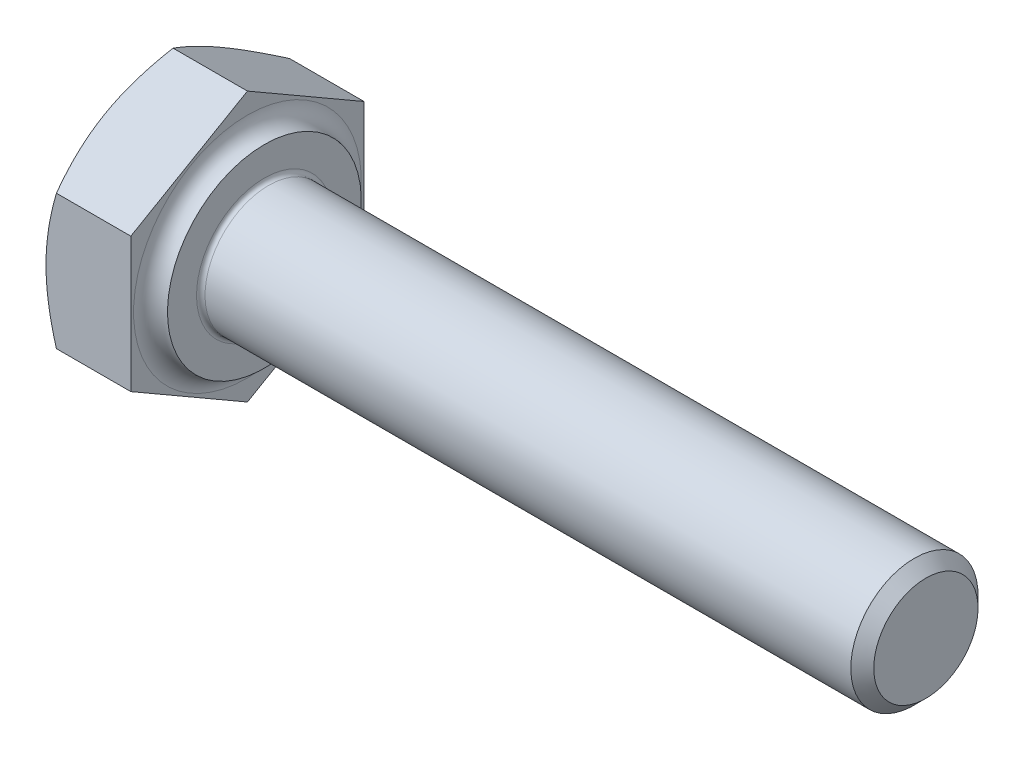
ISO-10303-21;
HEADER;
FILE_DESCRIPTION(('STEP AP214'),'2;1');
FILE_NAME('part.step','',(''),(''),'','','');
FILE_SCHEMA(('AUTOMOTIVE_DESIGN { 1 0 10303 214 1 1 1 1 }'));
ENDSEC;
DATA;
#1=APPLICATION_CONTEXT('core data for automotive mechanical design processes');
#2=APPLICATION_PROTOCOL_DEFINITION('international standard','automotive_design',2000,#1);
#3=PRODUCT_CONTEXT('',#1,'mechanical');
#4=PRODUCT('Part','Part','',(#3));
#5=PRODUCT_RELATED_PRODUCT_CATEGORY('part','',(#4));
#6=PRODUCT_DEFINITION_FORMATION('','',#4);
#7=PRODUCT_DEFINITION_CONTEXT('part definition',#1,'design');
#8=PRODUCT_DEFINITION('design','',#6,#7);
#9=PRODUCT_DEFINITION_SHAPE('','',#8);
#10=(LENGTH_UNIT() NAMED_UNIT(*) SI_UNIT(.MILLI.,.METRE.));
#11=(NAMED_UNIT(*) PLANE_ANGLE_UNIT() SI_UNIT($,.RADIAN.));
#12=(NAMED_UNIT(*) SI_UNIT($,.STERADIAN.) SOLID_ANGLE_UNIT());
#13=UNCERTAINTY_MEASURE_WITH_UNIT(LENGTH_MEASURE(1.E-05),#10,'distance_accuracy_value','');
#14=(GEOMETRIC_REPRESENTATION_CONTEXT(3) GLOBAL_UNCERTAINTY_ASSIGNED_CONTEXT((#13)) GLOBAL_UNIT_ASSIGNED_CONTEXT((#10,
#11,#12)) REPRESENTATION_CONTEXT('',''));
#15=CARTESIAN_POINT('',(0.,0.,0.));
#16=DIRECTION('',(0.,0.,1.));
#17=DIRECTION('',(1.,0.,0.));
#18=AXIS2_PLACEMENT_3D('',#15,#16,#17);
#19=CARTESIAN_POINT('',(0.4,0.,0.));
#20=DIRECTION('',(1.,0.,0.));
#21=DIRECTION('',(0.,0.,-1.));
#22=AXIS2_PLACEMENT_3D('',#19,#20,#21);
#23=TOROIDAL_SURFACE('',#22,2.685,0.4);
#24=CARTESIAN_POINT('',(0.4,0.,0.));
#25=DIRECTION('',(1.,0.,0.));
#26=DIRECTION('',(0.,1.,0.));
#27=AXIS2_PLACEMENT_3D('',#24,#25,#26);
#28=CIRCLE('',#27,2.285);
#29=CARTESIAN_POINT('',(0.4,2.285,0.));
#30=VERTEX_POINT('',#29);
#31=EDGE_CURVE('E12',#30,#30,#28,.T.);
#32=ORIENTED_EDGE('',*,*,#31,.F.);
#33=EDGE_LOOP('',(#32));
#34=FACE_BOUND('',#33,.T.);
#35=CARTESIAN_POINT('',(0.,0.,0.));
#36=DIRECTION('',(-1.,0.,0.));
#37=DIRECTION('',(0.,1.,0.));
#38=AXIS2_PLACEMENT_3D('',#35,#36,#37);
#39=CIRCLE('',#38,2.685);
#40=CARTESIAN_POINT('',(0.,2.685,0.));
#41=VERTEX_POINT('',#40);
#42=EDGE_CURVE('E40',#41,#41,#39,.T.);
#43=ORIENTED_EDGE('',*,*,#42,.F.);
#44=EDGE_LOOP('',(#43));
#45=FACE_BOUND('',#44,.T.);
#46=ADVANCED_FACE('F19',(#34,#45),#23,.F.);
#47=CARTESIAN_POINT('',(0.4,1.9425,0.));
#48=DIRECTION('',(1.,0.,0.));
#49=DIRECTION('',(0.,1.,0.));
#50=AXIS2_PLACEMENT_3D('',#47,#48,#49);
#51=PLANE('',#50);
#52=CARTESIAN_POINT('',(0.4,0.,0.));
#53=DIRECTION('',(1.,0.,0.));
#54=DIRECTION('',(0.,1.,0.));
#55=AXIS2_PLACEMENT_3D('',#52,#53,#54);
#56=CIRCLE('',#55,1.6);
#57=CARTESIAN_POINT('',(0.4,1.6,0.));
#58=VERTEX_POINT('',#57);
#59=EDGE_CURVE('E30',#58,#58,#56,.T.);
#60=ORIENTED_EDGE('',*,*,#59,.F.);
#61=EDGE_LOOP('',(#60));
#62=FACE_BOUND('',#61,.T.);
#63=ORIENTED_EDGE('',*,*,#31,.T.);
#64=EDGE_LOOP('',(#63));
#65=FACE_BOUND('',#64,.T.);
#66=ADVANCED_FACE('F365',(#62,#65),#51,.T.);
#67=CARTESIAN_POINT('',(0.5,0.,0.));
#68=DIRECTION('',(1.,0.,0.));
#69=DIRECTION('',(0.,0.,-1.));
#70=AXIS2_PLACEMENT_3D('',#67,#68,#69);
#71=TOROIDAL_SURFACE('',#70,1.6,0.1);
#72=CARTESIAN_POINT('',(0.5,0.,0.));
#73=DIRECTION('',(1.,0.,0.));
#74=DIRECTION('',(0.,1.,0.));
#75=AXIS2_PLACEMENT_3D('',#72,#73,#74);
#76=CIRCLE('',#75,1.5);
#77=CARTESIAN_POINT('',(0.5,1.5,0.));
#78=VERTEX_POINT('',#77);
#79=EDGE_CURVE('E282',#78,#78,#76,.T.);
#80=ORIENTED_EDGE('',*,*,#79,.F.);
#81=EDGE_LOOP('',(#80));
#82=FACE_BOUND('',#81,.T.);
#83=ORIENTED_EDGE('',*,*,#59,.T.);
#84=EDGE_LOOP('',(#83));
#85=FACE_BOUND('',#84,.T.);
#86=ADVANCED_FACE('F369',(#82,#85),#71,.F.);
#87=CARTESIAN_POINT('',(8.1146875,0.,0.));
#88=DIRECTION('',(-1.,0.,0.));
#89=DIRECTION('',(0.,1.,0.));
#90=AXIS2_PLACEMENT_3D('',#87,#88,#89);
#91=CYLINDRICAL_SURFACE('',#90,1.5);
#92=CARTESIAN_POINT('',(15.729375,0.,0.));
#93=DIRECTION('',(1.,0.,0.));
#94=DIRECTION('',(0.,1.,0.));
#95=AXIS2_PLACEMENT_3D('',#92,#93,#94);
#96=CIRCLE('',#95,1.5);
#97=CARTESIAN_POINT('',(15.729375,1.5,0.));
#98=VERTEX_POINT('',#97);
#99=EDGE_CURVE('E23',#98,#98,#96,.T.);
#100=ORIENTED_EDGE('',*,*,#99,.F.);
#101=EDGE_LOOP('',(#100));
#102=FACE_BOUND('',#101,.T.);
#103=ORIENTED_EDGE('',*,*,#79,.T.);
#104=EDGE_LOOP('',(#103));
#105=FACE_BOUND('',#104,.T.);
#106=ADVANCED_FACE('F21',(#102,#105),#91,.T.);
#107=CARTESIAN_POINT('',(15.8646875,0.,0.));
#108=DIRECTION('',(-1.,0.,0.));
#109=DIRECTION('',(0.,1.,0.));
#110=AXIS2_PLACEMENT_3D('',#107,#108,#109);
#111=CONICAL_SURFACE('',#110,1.3646875,0.785398163397448);
#112=CARTESIAN_POINT('',(16.,0.,0.));
#113=DIRECTION('',(1.,0.,0.));
#114=DIRECTION('',(0.,1.,0.));
#115=AXIS2_PLACEMENT_3D('',#112,#113,#114);
#116=CIRCLE('',#115,1.229375);
#117=CARTESIAN_POINT('',(16.,1.229375,0.));
#118=VERTEX_POINT('',#117);
#119=EDGE_CURVE('E272',#118,#118,#116,.T.);
#120=ORIENTED_EDGE('',*,*,#119,.F.);
#121=EDGE_LOOP('',(#120));
#122=FACE_BOUND('',#121,.T.);
#123=ORIENTED_EDGE('',*,*,#99,.T.);
#124=EDGE_LOOP('',(#123));
#125=FACE_BOUND('',#124,.T.);
#126=ADVANCED_FACE('F382',(#122,#125),#111,.T.);
#127=CARTESIAN_POINT('',(16.,0.6146875,0.));
#128=DIRECTION('',(1.,0.,0.));
#129=DIRECTION('',(0.,1.,0.));
#130=AXIS2_PLACEMENT_3D('',#127,#128,#129);
#131=PLANE('',#130);
#132=ORIENTED_EDGE('',*,*,#119,.T.);
#133=EDGE_LOOP('',(#132));
#134=FACE_BOUND('',#133,.T.);
#135=ADVANCED_FACE('F384',(#134),#131,.T.);
#136=CARTESIAN_POINT('',(-1.87695222387896,0.,0.));
#137=DIRECTION('',(1.,0.,0.));
#138=DIRECTION('',(0.,1.,0.));
#139=AXIS2_PLACEMENT_3D('',#136,#137,#138);
#140=CONICAL_SURFACE('',#139,2.963125,1.0471975511966);
#141=CARTESIAN_POINT('',(-1.75390444775792,-1.58935963913144,2.75));
#142=CARTESIAN_POINT('',(-2.,-0.737521874306931,2.75));
#143=CARTESIAN_POINT('',(-2.,0.,2.75));
#144=CARTESIAN_POINT('',(-2.,0.737521874306933,2.75));
#145=CARTESIAN_POINT('',(-1.75390444775792,1.58935963913144,2.75));
#146=(BOUNDED_CURVE() B_SPLINE_CURVE(2,(#141,#142,#143,#144,#145),.UNSPECIFIED.,.F.,
.F.) B_SPLINE_CURVE_WITH_KNOTS((3,2,3),(0.,1.6124120093164,3.22482401863281),
.UNSPECIFIED.) CURVE() GEOMETRIC_REPRESENTATION_ITEM() RATIONAL_B_SPLINE_CURVE((1.,
1.03802697460134,1.,1.03802697460135,1.)) REPRESENTATION_ITEM(''));
#147=CARTESIAN_POINT('',(-1.75437990693814,-1.58771324027147,2.75));
#148=VERTEX_POINT('',#147);
#149=CARTESIAN_POINT('',(-2.,0.,2.75));
#150=VERTEX_POINT('',#149);
#151=EDGE_CURVE('E247',#148,#150,#146,.T.);
#152=ORIENTED_EDGE('',*,*,#151,.T.);
#153=CARTESIAN_POINT('',(-2.,0.,0.));
#154=DIRECTION('',(1.,0.,0.));
#155=DIRECTION('',(0.,1.,0.));
#156=AXIS2_PLACEMENT_3D('',#153,#154,#155);
#157=CIRCLE('',#156,2.75);
#158=CARTESIAN_POINT('',(-2.,-2.38156986040721,1.375));
#159=VERTEX_POINT('',#158);
#160=EDGE_CURVE('E243',#150,#159,#157,.T.);
#161=ORIENTED_EDGE('',*,*,#160,.T.);
#162=CARTESIAN_POINT('',(-1.75390444775792,-3.17624967997292,-0.00142582323749051));
#163=CARTESIAN_POINT('',(-2.,-2.75033079756068,0.736287321003484));
#164=CARTESIAN_POINT('',(-2.,-2.38156986040721,1.375));
#165=CARTESIAN_POINT('',(-2.,-2.01280892325374,2.01371267899651));
#166=CARTESIAN_POINT('',(-1.75390444775792,-1.58689004084149,2.75142582323749));
#167=(BOUNDED_CURVE() B_SPLINE_CURVE(2,(#162,#163,#164,#165,#166),.UNSPECIFIED.,.F.,
.F.) B_SPLINE_CURVE_WITH_KNOTS((3,2,3),(0.,1.6124120093164,3.22482401863281),
.UNSPECIFIED.) CURVE() GEOMETRIC_REPRESENTATION_ITEM() RATIONAL_B_SPLINE_CURVE((1.,
1.03802697460134,1.,1.03802697460134,1.)) REPRESENTATION_ITEM(''));
#168=EDGE_CURVE('E213',#159,#148,#167,.T.);
#169=ORIENTED_EDGE('',*,*,#168,.T.);
#170=EDGE_LOOP('',(#152,#161,#169));
#171=FACE_BOUND('',#170,.T.);
#172=ADVANCED_FACE('F338',(#171),#140,.T.);
#173=CARTESIAN_POINT('',(-1.87695222387896,0.,0.));
#174=DIRECTION('',(1.,0.,0.));
#175=DIRECTION('',(0.,1.,0.));
#176=AXIS2_PLACEMENT_3D('',#173,#174,#175);
#177=CONICAL_SURFACE('',#176,2.963125,1.0471975511966);
#178=CARTESIAN_POINT('',(-1.75390444775792,1.58689004084149,2.75142582323749));
#179=CARTESIAN_POINT('',(-2.,2.01280892325375,2.01371267899652));
#180=CARTESIAN_POINT('',(-2.,2.38156986040721,1.375));
#181=CARTESIAN_POINT('',(-2.,2.75033079756067,0.736287321003486));
#182=CARTESIAN_POINT('',(-1.75390444775792,3.17624967997292,-0.0014258232374917));
#183=(BOUNDED_CURVE() B_SPLINE_CURVE(2,(#178,#179,#180,#181,#182),.UNSPECIFIED.,.F.,
.F.) B_SPLINE_CURVE_WITH_KNOTS((3,2,3),(0.,1.6124120093164,3.22482401863281),
.UNSPECIFIED.) CURVE() GEOMETRIC_REPRESENTATION_ITEM() RATIONAL_B_SPLINE_CURVE((1.,
1.03802697460133,1.,1.03802697460134,1.)) REPRESENTATION_ITEM(''));
#184=CARTESIAN_POINT('',(-1.75437990693814,1.58771324027147,2.75));
#185=VERTEX_POINT('',#184);
#186=CARTESIAN_POINT('',(-2.,2.38156986040721,1.375));
#187=VERTEX_POINT('',#186);
#188=EDGE_CURVE('E206',#185,#187,#183,.T.);
#189=ORIENTED_EDGE('',*,*,#188,.T.);
#190=CARTESIAN_POINT('',(-2.,0.,0.));
#191=DIRECTION('',(1.,0.,0.));
#192=DIRECTION('',(0.,1.,0.));
#193=AXIS2_PLACEMENT_3D('',#190,#191,#192);
#194=CIRCLE('',#193,2.75);
#195=EDGE_CURVE('E214',#187,#150,#194,.T.);
#196=ORIENTED_EDGE('',*,*,#195,.T.);
#197=CARTESIAN_POINT('',(-1.75390444775792,-1.58935963913144,2.75));
#198=CARTESIAN_POINT('',(-2.,-0.737521874306931,2.75));
#199=CARTESIAN_POINT('',(-2.,0.,2.75));
#200=CARTESIAN_POINT('',(-2.,0.737521874306933,2.75));
#201=CARTESIAN_POINT('',(-1.75390444775792,1.58935963913144,2.75));
#202=(BOUNDED_CURVE() B_SPLINE_CURVE(2,(#197,#198,#199,#200,#201),.UNSPECIFIED.,.F.,
.F.) B_SPLINE_CURVE_WITH_KNOTS((3,2,3),(0.,1.6124120093164,3.22482401863281),
.UNSPECIFIED.) CURVE() GEOMETRIC_REPRESENTATION_ITEM() RATIONAL_B_SPLINE_CURVE((1.,
1.03802697460134,1.,1.03802697460135,1.)) REPRESENTATION_ITEM(''));
#203=EDGE_CURVE('E157',#150,#185,#202,.T.);
#204=ORIENTED_EDGE('',*,*,#203,.T.);
#205=EDGE_LOOP('',(#189,#196,#204));
#206=FACE_BOUND('',#205,.T.);
#207=ADVANCED_FACE('F347',(#206),#177,.T.);
#208=CARTESIAN_POINT('',(-1.87695222387896,0.,0.));
#209=DIRECTION('',(1.,0.,0.));
#210=DIRECTION('',(0.,1.,0.));
#211=AXIS2_PLACEMENT_3D('',#208,#209,#210);
#212=CONICAL_SURFACE('',#211,2.963125,1.0471975511966);
#213=CARTESIAN_POINT('',(-1.75390444775792,3.17624967997292,0.00142582323748956));
#214=CARTESIAN_POINT('',(-2.,2.75033079756067,-0.736287321003486));
#215=CARTESIAN_POINT('',(-2.,2.38156986040721,-1.375));
#216=CARTESIAN_POINT('',(-2.,2.01280892325374,-2.01371267899651));
#217=CARTESIAN_POINT('',(-1.75390444775792,1.58689004084149,-2.75142582323749));
#218=(BOUNDED_CURVE() B_SPLINE_CURVE(2,(#213,#214,#215,#216,#217),.UNSPECIFIED.,.F.,
.F.) B_SPLINE_CURVE_WITH_KNOTS((3,2,3),(0.,1.6124120093164,3.22482401863281),
.UNSPECIFIED.) CURVE() GEOMETRIC_REPRESENTATION_ITEM() RATIONAL_B_SPLINE_CURVE((1.,
1.03802697460134,1.,1.03802697460134,1.)) REPRESENTATION_ITEM(''));
#219=CARTESIAN_POINT('',(-1.75437990693813,3.17542648054294,0.));
#220=VERTEX_POINT('',#219);
#221=CARTESIAN_POINT('',(-2.,2.38156986040721,-1.375));
#222=VERTEX_POINT('',#221);
#223=EDGE_CURVE('E151',#220,#222,#218,.T.);
#224=ORIENTED_EDGE('',*,*,#223,.T.);
#225=CARTESIAN_POINT('',(-2.,0.,0.));
#226=DIRECTION('',(1.,0.,0.));
#227=DIRECTION('',(0.,1.,0.));
#228=AXIS2_PLACEMENT_3D('',#225,#226,#227);
#229=CIRCLE('',#228,2.75);
#230=EDGE_CURVE('E158',#222,#187,#229,.T.);
#231=ORIENTED_EDGE('',*,*,#230,.T.);
#232=CARTESIAN_POINT('',(-1.75390444775792,1.58689004084149,2.75142582323749));
#233=CARTESIAN_POINT('',(-2.,2.01280892325375,2.01371267899652));
#234=CARTESIAN_POINT('',(-2.,2.38156986040721,1.375));
#235=CARTESIAN_POINT('',(-2.,2.75033079756067,0.736287321003486));
#236=CARTESIAN_POINT('',(-1.75390444775792,3.17624967997292,-0.0014258232374917));
#237=(BOUNDED_CURVE() B_SPLINE_CURVE(2,(#232,#233,#234,#235,#236),.UNSPECIFIED.,.F.,
.F.) B_SPLINE_CURVE_WITH_KNOTS((3,2,3),(0.,1.6124120093164,3.22482401863281),
.UNSPECIFIED.) CURVE() GEOMETRIC_REPRESENTATION_ITEM() RATIONAL_B_SPLINE_CURVE((1.,
1.03802697460133,1.,1.03802697460134,1.)) REPRESENTATION_ITEM(''));
#238=EDGE_CURVE('E129',#187,#220,#237,.T.);
#239=ORIENTED_EDGE('',*,*,#238,.T.);
#240=EDGE_LOOP('',(#224,#231,#239));
#241=FACE_BOUND('',#240,.T.);
#242=ADVANCED_FACE('F353',(#241),#212,.T.);
#243=CARTESIAN_POINT('',(-1.87695222387896,0.,0.));
#244=DIRECTION('',(1.,0.,0.));
#245=DIRECTION('',(0.,1.,0.));
#246=AXIS2_PLACEMENT_3D('',#243,#244,#245);
#247=CONICAL_SURFACE('',#246,2.963125,1.0471975511966);
#248=CARTESIAN_POINT('',(-1.75390444775792,3.17624967997292,0.00142582323748956));
#249=CARTESIAN_POINT('',(-2.,2.75033079756067,-0.736287321003486));
#250=CARTESIAN_POINT('',(-2.,2.38156986040721,-1.375));
#251=CARTESIAN_POINT('',(-2.,2.01280892325374,-2.01371267899651));
#252=CARTESIAN_POINT('',(-1.75390444775792,1.58689004084149,-2.75142582323749));
#253=(BOUNDED_CURVE() B_SPLINE_CURVE(2,(#248,#249,#250,#251,#252),.UNSPECIFIED.,.F.,
.F.) B_SPLINE_CURVE_WITH_KNOTS((3,2,3),(0.,1.6124120093164,3.22482401863281),
.UNSPECIFIED.) CURVE() GEOMETRIC_REPRESENTATION_ITEM() RATIONAL_B_SPLINE_CURVE((1.,
1.03802697460134,1.,1.03802697460134,1.)) REPRESENTATION_ITEM(''));
#254=CARTESIAN_POINT('',(-1.75437990693814,1.58771324027147,-2.75));
#255=VERTEX_POINT('',#254);
#256=EDGE_CURVE('E121',#222,#255,#253,.T.);
#257=ORIENTED_EDGE('',*,*,#256,.T.);
#258=CARTESIAN_POINT('',(-1.75390444775792,1.58935963913144,-2.75));
#259=CARTESIAN_POINT('',(-2.,0.73752187430693,-2.75));
#260=CARTESIAN_POINT('',(-2.,0.,-2.75));
#261=CARTESIAN_POINT('',(-2.,-0.73752187430693,-2.75));
#262=CARTESIAN_POINT('',(-1.75390444775792,-1.58935963913144,-2.75));
#263=(BOUNDED_CURVE() B_SPLINE_CURVE(2,(#258,#259,#260,#261,#262),.UNSPECIFIED.,.F.,
.F.) B_SPLINE_CURVE_WITH_KNOTS((3,2,3),(0.,1.6124120093164,3.22482401863281),
.UNSPECIFIED.) CURVE() GEOMETRIC_REPRESENTATION_ITEM() RATIONAL_B_SPLINE_CURVE((1.,
1.03802697460134,1.,1.03802697460134,1.)) REPRESENTATION_ITEM(''));
#264=CARTESIAN_POINT('',(-2.,0.,-2.75));
#265=VERTEX_POINT('',#264);
#266=EDGE_CURVE('E108',#255,#265,#263,.T.);
#267=ORIENTED_EDGE('',*,*,#266,.T.);
#268=CARTESIAN_POINT('',(-2.,0.,0.));
#269=DIRECTION('',(1.,0.,0.));
#270=DIRECTION('',(0.,1.,0.));
#271=AXIS2_PLACEMENT_3D('',#268,#269,#270);
#272=CIRCLE('',#271,2.75);
#273=EDGE_CURVE('E122',#265,#222,#272,.T.);
#274=ORIENTED_EDGE('',*,*,#273,.T.);
#275=EDGE_LOOP('',(#257,#267,#274));
#276=FACE_BOUND('',#275,.T.);
#277=ADVANCED_FACE('F124',(#276),#247,.T.);
#278=CARTESIAN_POINT('',(-1.87695222387896,0.,0.));
#279=DIRECTION('',(1.,0.,0.));
#280=DIRECTION('',(0.,1.,0.));
#281=AXIS2_PLACEMENT_3D('',#278,#279,#280);
#282=CONICAL_SURFACE('',#281,2.963125,1.0471975511966);
#283=CARTESIAN_POINT('',(-1.75390444775792,1.58935963913144,-2.75));
#284=CARTESIAN_POINT('',(-2.,0.73752187430693,-2.75));
#285=CARTESIAN_POINT('',(-2.,0.,-2.75));
#286=CARTESIAN_POINT('',(-2.,-0.73752187430693,-2.75));
#287=CARTESIAN_POINT('',(-1.75390444775792,-1.58935963913144,-2.75));
#288=(BOUNDED_CURVE() B_SPLINE_CURVE(2,(#283,#284,#285,#286,#287),.UNSPECIFIED.,.F.,
.F.) B_SPLINE_CURVE_WITH_KNOTS((3,2,3),(0.,1.6124120093164,3.22482401863281),
.UNSPECIFIED.) CURVE() GEOMETRIC_REPRESENTATION_ITEM() RATIONAL_B_SPLINE_CURVE((1.,
1.03802697460134,1.,1.03802697460134,1.)) REPRESENTATION_ITEM(''));
#289=CARTESIAN_POINT('',(-1.75437990693813,-1.58771324027147,-2.75));
#290=VERTEX_POINT('',#289);
#291=EDGE_CURVE('E115',#265,#290,#288,.T.);
#292=ORIENTED_EDGE('',*,*,#291,.T.);
#293=CARTESIAN_POINT('',(-1.75390444775792,-1.58689004084149,-2.75142582323749));
#294=CARTESIAN_POINT('',(-2.,-2.01280892325374,-2.01371267899652));
#295=CARTESIAN_POINT('',(-2.,-2.38156986040721,-1.375));
#296=CARTESIAN_POINT('',(-2.,-2.75033079756067,-0.736287321003484));
#297=CARTESIAN_POINT('',(-1.75390444775792,-3.17624967997292,0.00142582323749194));
#298=(BOUNDED_CURVE() B_SPLINE_CURVE(2,(#293,#294,#295,#296,#297),.UNSPECIFIED.,.F.,
.F.) B_SPLINE_CURVE_WITH_KNOTS((3,2,3),(0.,1.6124120093164,3.22482401863281),
.UNSPECIFIED.) CURVE() GEOMETRIC_REPRESENTATION_ITEM() RATIONAL_B_SPLINE_CURVE((1.,
1.03802697460134,1.,1.03802697460135,1.)) REPRESENTATION_ITEM(''));
#299=CARTESIAN_POINT('',(-2.,-2.38156986040721,-1.375));
#300=VERTEX_POINT('',#299);
#301=EDGE_CURVE('E177',#290,#300,#298,.T.);
#302=ORIENTED_EDGE('',*,*,#301,.T.);
#303=CARTESIAN_POINT('',(-2.,0.,0.));
#304=DIRECTION('',(1.,0.,0.));
#305=DIRECTION('',(0.,1.,0.));
#306=AXIS2_PLACEMENT_3D('',#303,#304,#305);
#307=CIRCLE('',#306,2.75);
#308=EDGE_CURVE('E186',#300,#265,#307,.T.);
#309=ORIENTED_EDGE('',*,*,#308,.T.);
#310=EDGE_LOOP('',(#292,#302,#309));
#311=FACE_BOUND('',#310,.T.);
#312=ADVANCED_FACE('F321',(#311),#282,.T.);
#313=CARTESIAN_POINT('',(-1.87695222387896,0.,0.));
#314=DIRECTION('',(1.,0.,0.));
#315=DIRECTION('',(0.,1.,0.));
#316=AXIS2_PLACEMENT_3D('',#313,#314,#315);
#317=CONICAL_SURFACE('',#316,2.963125,1.0471975511966);
#318=CARTESIAN_POINT('',(-1.75390444775792,-1.58689004084149,-2.75142582323749));
#319=CARTESIAN_POINT('',(-2.,-2.01280892325374,-2.01371267899652));
#320=CARTESIAN_POINT('',(-2.,-2.38156986040721,-1.375));
#321=CARTESIAN_POINT('',(-2.,-2.75033079756067,-0.736287321003484));
#322=CARTESIAN_POINT('',(-1.75390444775792,-3.17624967997292,0.00142582323749194));
#323=(BOUNDED_CURVE() B_SPLINE_CURVE(2,(#318,#319,#320,#321,#322),.UNSPECIFIED.,.F.,
.F.) B_SPLINE_CURVE_WITH_KNOTS((3,2,3),(0.,1.6124120093164,3.22482401863281),
.UNSPECIFIED.) CURVE() GEOMETRIC_REPRESENTATION_ITEM() RATIONAL_B_SPLINE_CURVE((1.,
1.03802697460134,1.,1.03802697460135,1.)) REPRESENTATION_ITEM(''));
#324=CARTESIAN_POINT('',(-1.75437990693813,-3.17542648054294,0.));
#325=VERTEX_POINT('',#324);
#326=EDGE_CURVE('E187',#300,#325,#323,.T.);
#327=ORIENTED_EDGE('',*,*,#326,.T.);
#328=CARTESIAN_POINT('',(-1.75390444775792,-3.17624967997292,-0.00142582323749051));
#329=CARTESIAN_POINT('',(-2.,-2.75033079756068,0.736287321003484));
#330=CARTESIAN_POINT('',(-2.,-2.38156986040721,1.375));
#331=CARTESIAN_POINT('',(-2.,-2.01280892325374,2.01371267899651));
#332=CARTESIAN_POINT('',(-1.75390444775792,-1.58689004084149,2.75142582323749));
#333=(BOUNDED_CURVE() B_SPLINE_CURVE(2,(#328,#329,#330,#331,#332),.UNSPECIFIED.,.F.,
.F.) B_SPLINE_CURVE_WITH_KNOTS((3,2,3),(0.,1.6124120093164,3.22482401863281),
.UNSPECIFIED.) CURVE() GEOMETRIC_REPRESENTATION_ITEM() RATIONAL_B_SPLINE_CURVE((1.,
1.03802697460134,1.,1.03802697460134,1.)) REPRESENTATION_ITEM(''));
#334=EDGE_CURVE('E197',#325,#159,#333,.T.);
#335=ORIENTED_EDGE('',*,*,#334,.T.);
#336=CARTESIAN_POINT('',(-2.,0.,0.));
#337=DIRECTION('',(1.,0.,0.));
#338=DIRECTION('',(0.,1.,0.));
#339=AXIS2_PLACEMENT_3D('',#336,#337,#338);
#340=CIRCLE('',#339,2.75);
#341=EDGE_CURVE('E149',#159,#300,#340,.T.);
#342=ORIENTED_EDGE('',*,*,#341,.T.);
#343=EDGE_LOOP('',(#327,#335,#342));
#344=FACE_BOUND('',#343,.T.);
#345=ADVANCED_FACE('F330',(#344),#317,.T.);
#346=CARTESIAN_POINT('',(-2.,1.375,0.));
#347=DIRECTION('',(-1.,0.,0.));
#348=DIRECTION('',(0.,-1.,0.));
#349=AXIS2_PLACEMENT_3D('',#346,#347,#348);
#350=PLANE('',#349);
#351=ORIENTED_EDGE('',*,*,#230,.F.);
#352=ORIENTED_EDGE('',*,*,#273,.F.);
#353=ORIENTED_EDGE('',*,*,#308,.F.);
#354=ORIENTED_EDGE('',*,*,#341,.F.);
#355=ORIENTED_EDGE('',*,*,#160,.F.);
#356=ORIENTED_EDGE('',*,*,#195,.F.);
#357=EDGE_LOOP('',(#351,#352,#353,#354,#355,#356));
#358=FACE_BOUND('',#357,.T.);
#359=ADVANCED_FACE('F333',(#358),#350,.T.);
#360=CARTESIAN_POINT('',(0.,1.588125,0.));
#361=DIRECTION('',(1.,0.,0.));
#362=DIRECTION('',(0.,1.,0.));
#363=AXIS2_PLACEMENT_3D('',#360,#361,#362);
#364=PLANE('',#363);
#365=ORIENTED_EDGE('',*,*,#42,.T.);
#366=EDGE_LOOP('',(#365));
#367=FACE_BOUND('',#366,.T.);
#368=DIRECTION('',(0.,-0.5,-0.866025403784439));
#369=VECTOR('',#368,1.);
#370=CARTESIAN_POINT('',(0.,-2.18305423540721,1.71883914859629));
#371=LINE('',#370,#369);
#372=CARTESIAN_POINT('',(0.,-1.58771324027147,2.75));
#373=VERTEX_POINT('',#372);
#374=CARTESIAN_POINT('',(0.,-3.17542648054294,0.));
#375=VERTEX_POINT('',#374);
#376=EDGE_CURVE('E263',#373,#375,#371,.T.);
#377=ORIENTED_EDGE('',*,*,#376,.T.);
#378=DIRECTION('',(0.,0.5,-0.866025403784439));
#379=VECTOR('',#378,1.);
#380=CARTESIAN_POINT('',(0.,-2.18305423540721,-1.71883914859629));
#381=LINE('',#380,#379);
#382=CARTESIAN_POINT('',(0.,-1.58771324027147,-2.75));
#383=VERTEX_POINT('',#382);
#384=EDGE_CURVE('E175',#375,#383,#381,.T.);
#385=ORIENTED_EDGE('',*,*,#384,.T.);
#386=DIRECTION('',(0.,1.,0.));
#387=VECTOR('',#386,1.);
#388=CARTESIAN_POINT('',(0.,0.7940625,-2.75));
#389=LINE('',#388,#387);
#390=CARTESIAN_POINT('',(0.,1.58771324027147,-2.75));
#391=VERTEX_POINT('',#390);
#392=EDGE_CURVE('E238',#383,#391,#389,.T.);
#393=ORIENTED_EDGE('',*,*,#392,.T.);
#394=DIRECTION('',(0.,0.5,0.866025403784439));
#395=VECTOR('',#394,1.);
#396=CARTESIAN_POINT('',(0.,2.58008548540721,-1.03116085140371));
#397=LINE('',#396,#395);
#398=CARTESIAN_POINT('',(0.,3.17542648054294,0.));
#399=VERTEX_POINT('',#398);
#400=EDGE_CURVE('E134',#391,#399,#397,.T.);
#401=ORIENTED_EDGE('',*,*,#400,.T.);
#402=DIRECTION('',(0.,-0.5,0.866025403784439));
#403=VECTOR('',#402,1.);
#404=CARTESIAN_POINT('',(0.,2.58008548540721,1.03116085140371));
#405=LINE('',#404,#403);
#406=CARTESIAN_POINT('',(0.,1.58771324027147,2.75));
#407=VERTEX_POINT('',#406);
#408=EDGE_CURVE('E204',#399,#407,#405,.T.);
#409=ORIENTED_EDGE('',*,*,#408,.T.);
#410=DIRECTION('',(0.,-1.,0.));
#411=VECTOR('',#410,1.);
#412=CARTESIAN_POINT('',(0.,0.7940625,2.75));
#413=LINE('',#412,#411);
#414=EDGE_CURVE('E198',#407,#373,#413,.T.);
#415=ORIENTED_EDGE('',*,*,#414,.T.);
#416=EDGE_LOOP('',(#377,#385,#393,#401,#409,#415));
#417=FACE_BOUND('',#416,.T.);
#418=ADVANCED_FACE('F314',(#367,#417),#364,.T.);
#419=CARTESIAN_POINT('',(-2.4,2.38156986040721,1.375));
#420=DIRECTION('',(0.,0.866025403784439,0.5));
#421=DIRECTION('',(0.,-0.5,0.866025403784439));
#422=AXIS2_PLACEMENT_3D('',#419,#420,#421);
#423=PLANE('',#422);
#424=ORIENTED_EDGE('',*,*,#238,.F.);
#425=ORIENTED_EDGE('',*,*,#188,.F.);
#426=DIRECTION('',(1.,0.,0.));
#427=VECTOR('',#426,1.);
#428=CARTESIAN_POINT('',(-2.4,1.58771324027147,2.75));
#429=LINE('',#428,#427);
#430=EDGE_CURVE('E205',#185,#407,#429,.T.);
#431=ORIENTED_EDGE('',*,*,#430,.T.);
#432=ORIENTED_EDGE('',*,*,#408,.F.);
#433=DIRECTION('',(1.,0.,0.));
#434=VECTOR('',#433,1.);
#435=CARTESIAN_POINT('',(-2.4,3.17542648054294,0.));
#436=LINE('',#435,#434);
#437=EDGE_CURVE('E137',#220,#399,#436,.T.);
#438=ORIENTED_EDGE('',*,*,#437,.F.);
#439=EDGE_LOOP('',(#424,#425,#431,#432,#438));
#440=FACE_BOUND('',#439,.T.);
#441=ADVANCED_FACE('F351',(#440),#423,.T.);
#442=CARTESIAN_POINT('',(-2.4,0.,2.75));
#443=DIRECTION('',(0.,0.,1.));
#444=DIRECTION('',(0.,-1.,0.));
#445=AXIS2_PLACEMENT_3D('',#442,#443,#444);
#446=PLANE('',#445);
#447=ORIENTED_EDGE('',*,*,#203,.F.);
#448=ORIENTED_EDGE('',*,*,#151,.F.);
#449=DIRECTION('',(1.,0.,0.));
#450=VECTOR('',#449,1.);
#451=CARTESIAN_POINT('',(-2.4,-1.58771324027147,2.75));
#452=LINE('',#451,#450);
#453=EDGE_CURVE('E242',#148,#373,#452,.T.);
#454=ORIENTED_EDGE('',*,*,#453,.T.);
#455=ORIENTED_EDGE('',*,*,#414,.F.);
#456=ORIENTED_EDGE('',*,*,#430,.F.);
#457=EDGE_LOOP('',(#447,#448,#454,#455,#456));
#458=FACE_BOUND('',#457,.T.);
#459=ADVANCED_FACE('F342',(#458),#446,.T.);
#460=CARTESIAN_POINT('',(-2.4,-2.38156986040721,1.375));
#461=DIRECTION('',(0.,-0.866025403784439,0.5));
#462=DIRECTION('',(0.,-0.5,-0.866025403784439));
#463=AXIS2_PLACEMENT_3D('',#460,#461,#462);
#464=PLANE('',#463);
#465=ORIENTED_EDGE('',*,*,#168,.F.);
#466=ORIENTED_EDGE('',*,*,#334,.F.);
#467=DIRECTION('',(1.,0.,0.));
#468=VECTOR('',#467,1.);
#469=CARTESIAN_POINT('',(-2.4,-3.17542648054294,0.));
#470=LINE('',#469,#468);
#471=EDGE_CURVE('E143',#325,#375,#470,.T.);
#472=ORIENTED_EDGE('',*,*,#471,.T.);
#473=ORIENTED_EDGE('',*,*,#376,.F.);
#474=ORIENTED_EDGE('',*,*,#453,.F.);
#475=EDGE_LOOP('',(#465,#466,#472,#473,#474));
#476=FACE_BOUND('',#475,.T.);
#477=ADVANCED_FACE('F389',(#476),#464,.T.);
#478=CARTESIAN_POINT('',(-2.4,2.38156986040721,-1.375));
#479=DIRECTION('',(0.,0.866025403784439,-0.5));
#480=DIRECTION('',(0.,0.5,0.866025403784439));
#481=AXIS2_PLACEMENT_3D('',#478,#479,#480);
#482=PLANE('',#481);
#483=ORIENTED_EDGE('',*,*,#223,.F.);
#484=ORIENTED_EDGE('',*,*,#437,.T.);
#485=ORIENTED_EDGE('',*,*,#400,.F.);
#486=DIRECTION('',(1.,0.,0.));
#487=VECTOR('',#486,1.);
#488=CARTESIAN_POINT('',(-2.4,1.58771324027147,-2.75));
#489=LINE('',#488,#487);
#490=EDGE_CURVE('E112',#255,#391,#489,.T.);
#491=ORIENTED_EDGE('',*,*,#490,.F.);
#492=ORIENTED_EDGE('',*,*,#256,.F.);
#493=EDGE_LOOP('',(#483,#484,#485,#491,#492));
#494=FACE_BOUND('',#493,.T.);
#495=ADVANCED_FACE('F131',(#494),#482,.T.);
#496=CARTESIAN_POINT('',(-2.4,0.,-2.75));
#497=DIRECTION('',(0.,0.,-1.));
#498=DIRECTION('',(0.,1.,0.));
#499=AXIS2_PLACEMENT_3D('',#496,#497,#498);
#500=PLANE('',#499);
#501=ORIENTED_EDGE('',*,*,#266,.F.);
#502=ORIENTED_EDGE('',*,*,#490,.T.);
#503=ORIENTED_EDGE('',*,*,#392,.F.);
#504=DIRECTION('',(1.,0.,0.));
#505=VECTOR('',#504,1.);
#506=CARTESIAN_POINT('',(-2.4,-1.58771324027147,-2.75));
#507=LINE('',#506,#505);
#508=EDGE_CURVE('E138',#290,#383,#507,.T.);
#509=ORIENTED_EDGE('',*,*,#508,.F.);
#510=ORIENTED_EDGE('',*,*,#291,.F.);
#511=EDGE_LOOP('',(#501,#502,#503,#509,#510));
#512=FACE_BOUND('',#511,.T.);
#513=ADVANCED_FACE('F110',(#512),#500,.T.);
#514=CARTESIAN_POINT('',(-2.4,-2.38156986040721,-1.375));
#515=DIRECTION('',(0.,-0.866025403784439,-0.5));
#516=DIRECTION('',(0.,0.5,-0.866025403784439));
#517=AXIS2_PLACEMENT_3D('',#514,#515,#516);
#518=PLANE('',#517);
#519=ORIENTED_EDGE('',*,*,#301,.F.);
#520=ORIENTED_EDGE('',*,*,#508,.T.);
#521=ORIENTED_EDGE('',*,*,#384,.F.);
#522=ORIENTED_EDGE('',*,*,#471,.F.);
#523=ORIENTED_EDGE('',*,*,#326,.F.);
#524=EDGE_LOOP('',(#519,#520,#521,#522,#523));
#525=FACE_BOUND('',#524,.T.);
#526=ADVANCED_FACE('F317',(#525),#518,.T.);
#527=CLOSED_SHELL('',(#46,#66,#86,#106,#126,#135,#172,#207,#242,#277,#312,#345,#359,#418,#441,
#459,#477,#495,#513,#526));
#528=MANIFOLD_SOLID_BREP('B1',#527);
#529=ADVANCED_BREP_SHAPE_REPRESENTATION('',(#18,#528),#14);
#530=SHAPE_DEFINITION_REPRESENTATION(#9,#529);
ENDSEC;
END-ISO-10303-21;
